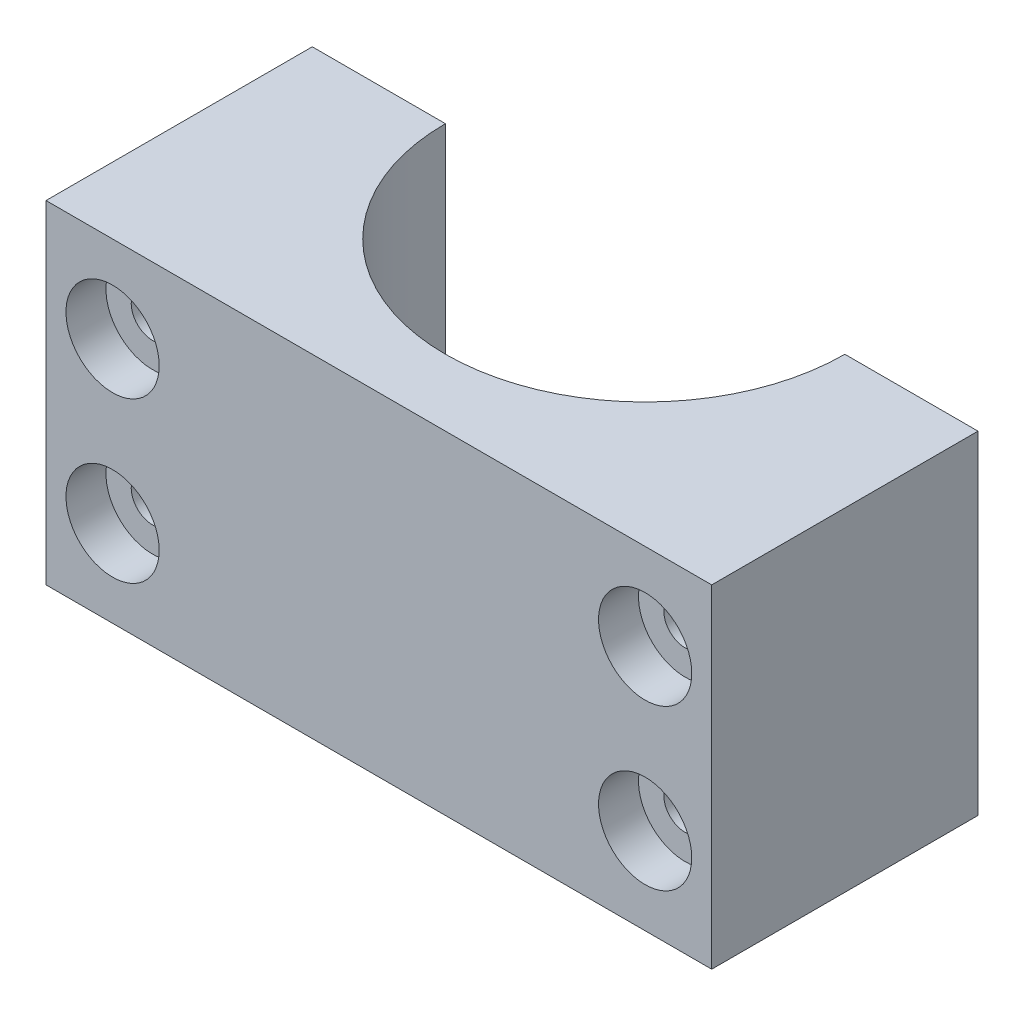
ISO-10303-21;
HEADER;
FILE_DESCRIPTION(('STEP AP214'),'2;1');
FILE_NAME('part.step','',(''),(''),'','','');
FILE_SCHEMA(('AUTOMOTIVE_DESIGN { 1 0 10303 214 1 1 1 1 }'));
ENDSEC;
DATA;
#1=APPLICATION_CONTEXT('core data for automotive mechanical design processes');
#2=APPLICATION_PROTOCOL_DEFINITION('international standard','automotive_design',2000,#1);
#3=PRODUCT_CONTEXT('',#1,'mechanical');
#4=PRODUCT('Part','Part','',(#3));
#5=PRODUCT_RELATED_PRODUCT_CATEGORY('part','',(#4));
#6=PRODUCT_DEFINITION_FORMATION('','',#4);
#7=PRODUCT_DEFINITION_CONTEXT('part definition',#1,'design');
#8=PRODUCT_DEFINITION('design','',#6,#7);
#9=PRODUCT_DEFINITION_SHAPE('','',#8);
#10=(LENGTH_UNIT() NAMED_UNIT(*) SI_UNIT(.MILLI.,.METRE.));
#11=(NAMED_UNIT(*) PLANE_ANGLE_UNIT() SI_UNIT($,.RADIAN.));
#12=(NAMED_UNIT(*) SI_UNIT($,.STERADIAN.) SOLID_ANGLE_UNIT());
#13=UNCERTAINTY_MEASURE_WITH_UNIT(LENGTH_MEASURE(1.E-05),#10,'distance_accuracy_value','');
#14=(GEOMETRIC_REPRESENTATION_CONTEXT(3) GLOBAL_UNCERTAINTY_ASSIGNED_CONTEXT((#13)) GLOBAL_UNIT_ASSIGNED_CONTEXT((#10,
#11,#12)) REPRESENTATION_CONTEXT('',''));
#15=CARTESIAN_POINT('',(0.,0.,0.));
#16=DIRECTION('',(0.,0.,1.));
#17=DIRECTION('',(1.,0.,0.));
#18=AXIS2_PLACEMENT_3D('',#15,#16,#17);
#19=CARTESIAN_POINT('',(20.0276243093923,6.5,45.));
#20=DIRECTION('',(0.,0.,-1.));
#21=DIRECTION('',(-1.,0.,0.));
#22=AXIS2_PLACEMENT_3D('',#19,#20,#21);
#23=CYLINDRICAL_SURFACE('',#22,1.6);
#24=CARTESIAN_POINT('',(20.0276243093923,6.5,0.));
#25=DIRECTION('',(0.,0.,-1.));
#26=DIRECTION('',(-1.,0.,0.));
#27=AXIS2_PLACEMENT_3D('',#24,#25,#26);
#28=CIRCLE('',#27,1.6);
#29=CARTESIAN_POINT('',(18.4276243093923,6.5,0.));
#30=VERTEX_POINT('',#29);
#31=EDGE_CURVE('E125',#30,#30,#28,.T.);
#32=ORIENTED_EDGE('',*,*,#31,.T.);
#33=EDGE_LOOP('',(#32));
#34=FACE_BOUND('',#33,.T.);
#35=CARTESIAN_POINT('',(20.0276243093923,6.5,17.));
#36=DIRECTION('',(0.,0.,1.));
#37=DIRECTION('',(1.,0.,0.));
#38=AXIS2_PLACEMENT_3D('',#35,#36,#37);
#39=CIRCLE('',#38,1.6);
#40=CARTESIAN_POINT('',(21.6276243093923,6.5,17.));
#41=VERTEX_POINT('',#40);
#42=EDGE_CURVE('E38',#41,#41,#39,.F.);
#43=ORIENTED_EDGE('',*,*,#42,.F.);
#44=EDGE_LOOP('',(#43));
#45=FACE_BOUND('',#44,.T.);
#46=ADVANCED_FACE('F34',(#34,#45),#23,.F.);
#47=CARTESIAN_POINT('',(-19.9723756906077,18.5,45.));
#48=DIRECTION('',(0.,0.,-1.));
#49=DIRECTION('',(-1.,0.,0.));
#50=AXIS2_PLACEMENT_3D('',#47,#48,#49);
#51=CYLINDRICAL_SURFACE('',#50,1.6);
#52=CARTESIAN_POINT('',(-19.9723756906077,18.5,0.));
#53=DIRECTION('',(0.,0.,-1.));
#54=DIRECTION('',(-1.,0.,0.));
#55=AXIS2_PLACEMENT_3D('',#52,#53,#54);
#56=CIRCLE('',#55,1.6);
#57=CARTESIAN_POINT('',(-21.5723756906077,18.5,0.));
#58=VERTEX_POINT('',#57);
#59=EDGE_CURVE('E141',#58,#58,#56,.T.);
#60=ORIENTED_EDGE('',*,*,#59,.T.);
#61=EDGE_LOOP('',(#60));
#62=FACE_BOUND('',#61,.T.);
#63=CARTESIAN_POINT('',(-19.9723756906077,18.5,17.));
#64=DIRECTION('',(0.,0.,1.));
#65=DIRECTION('',(1.,0.,0.));
#66=AXIS2_PLACEMENT_3D('',#63,#64,#65);
#67=CIRCLE('',#66,1.6);
#68=CARTESIAN_POINT('',(-18.3723756906077,18.5,17.));
#69=VERTEX_POINT('',#68);
#70=EDGE_CURVE('E145',#69,#69,#67,.F.);
#71=ORIENTED_EDGE('',*,*,#70,.F.);
#72=EDGE_LOOP('',(#71));
#73=FACE_BOUND('',#72,.T.);
#74=ADVANCED_FACE('F197',(#62,#73),#51,.F.);
#75=CARTESIAN_POINT('',(-19.9723756906077,6.5,45.));
#76=DIRECTION('',(0.,0.,-1.));
#77=DIRECTION('',(-1.,0.,0.));
#78=AXIS2_PLACEMENT_3D('',#75,#76,#77);
#79=CYLINDRICAL_SURFACE('',#78,1.6);
#80=CARTESIAN_POINT('',(-19.9723756906077,6.5,0.));
#81=DIRECTION('',(0.,0.,-1.));
#82=DIRECTION('',(-1.,0.,0.));
#83=AXIS2_PLACEMENT_3D('',#80,#81,#82);
#84=CIRCLE('',#83,1.6);
#85=CARTESIAN_POINT('',(-21.5723756906077,6.5,0.));
#86=VERTEX_POINT('',#85);
#87=EDGE_CURVE('E165',#86,#86,#84,.T.);
#88=ORIENTED_EDGE('',*,*,#87,.T.);
#89=EDGE_LOOP('',(#88));
#90=FACE_BOUND('',#89,.T.);
#91=CARTESIAN_POINT('',(-19.9723756906077,6.5,17.));
#92=DIRECTION('',(0.,0.,1.));
#93=DIRECTION('',(1.,0.,0.));
#94=AXIS2_PLACEMENT_3D('',#91,#92,#93);
#95=CIRCLE('',#94,1.6);
#96=CARTESIAN_POINT('',(-18.3723756906077,6.5,17.));
#97=VERTEX_POINT('',#96);
#98=EDGE_CURVE('E143',#97,#97,#95,.F.);
#99=ORIENTED_EDGE('',*,*,#98,.F.);
#100=EDGE_LOOP('',(#99));
#101=FACE_BOUND('',#100,.T.);
#102=ADVANCED_FACE('F203',(#90,#101),#79,.F.);
#103=CARTESIAN_POINT('',(20.0276243093923,18.5,45.));
#104=DIRECTION('',(0.,0.,-1.));
#105=DIRECTION('',(-1.,0.,0.));
#106=AXIS2_PLACEMENT_3D('',#103,#104,#105);
#107=CYLINDRICAL_SURFACE('',#106,1.6);
#108=CARTESIAN_POINT('',(20.0276243093923,18.5,0.));
#109=DIRECTION('',(0.,0.,-1.));
#110=DIRECTION('',(-1.,0.,0.));
#111=AXIS2_PLACEMENT_3D('',#108,#109,#110);
#112=CIRCLE('',#111,1.6);
#113=CARTESIAN_POINT('',(18.4276243093923,18.5,0.));
#114=VERTEX_POINT('',#113);
#115=EDGE_CURVE('E162',#114,#114,#112,.T.);
#116=ORIENTED_EDGE('',*,*,#115,.T.);
#117=EDGE_LOOP('',(#116));
#118=FACE_BOUND('',#117,.T.);
#119=CARTESIAN_POINT('',(20.0276243093923,18.5,17.));
#120=DIRECTION('',(0.,0.,1.));
#121=DIRECTION('',(1.,0.,0.));
#122=AXIS2_PLACEMENT_3D('',#119,#120,#121);
#123=CIRCLE('',#122,1.6);
#124=CARTESIAN_POINT('',(21.6276243093923,18.5,17.));
#125=VERTEX_POINT('',#124);
#126=EDGE_CURVE('E138',#125,#125,#123,.F.);
#127=ORIENTED_EDGE('',*,*,#126,.F.);
#128=EDGE_LOOP('',(#127));
#129=FACE_BOUND('',#128,.T.);
#130=ADVANCED_FACE('F227',(#118,#129),#107,.F.);
#131=CARTESIAN_POINT('',(-24.9723756906077,25.,0.));
#132=DIRECTION('',(1.,0.,0.));
#133=DIRECTION('',(0.,0.,-1.));
#134=AXIS2_PLACEMENT_3D('',#131,#132,#133);
#135=PLANE('',#134);
#136=DIRECTION('',(0.,0.,1.));
#137=VECTOR('',#136,1.);
#138=CARTESIAN_POINT('',(-24.9723756906077,0.,0.));
#139=LINE('',#138,#137);
#140=CARTESIAN_POINT('',(-24.9723756906077,0.,0.));
#141=VERTEX_POINT('',#140);
#142=CARTESIAN_POINT('',(-24.9723756906077,0.,20.));
#143=VERTEX_POINT('',#142);
#144=EDGE_CURVE('E121',#141,#143,#139,.T.);
#145=ORIENTED_EDGE('',*,*,#144,.T.);
#146=DIRECTION('',(0.,-1.,0.));
#147=VECTOR('',#146,1.);
#148=CARTESIAN_POINT('',(-24.9723756906077,25.,20.));
#149=LINE('',#148,#147);
#150=CARTESIAN_POINT('',(-24.9723756906077,25.,20.));
#151=VERTEX_POINT('',#150);
#152=EDGE_CURVE('E11',#151,#143,#149,.T.);
#153=ORIENTED_EDGE('',*,*,#152,.F.);
#154=DIRECTION('',(0.,0.,1.));
#155=VECTOR('',#154,1.);
#156=CARTESIAN_POINT('',(-24.9723756906077,25.,0.));
#157=LINE('',#156,#155);
#158=CARTESIAN_POINT('',(-24.9723756906077,25.,0.));
#159=VERTEX_POINT('',#158);
#160=EDGE_CURVE('E132',#159,#151,#157,.T.);
#161=ORIENTED_EDGE('',*,*,#160,.F.);
#162=DIRECTION('',(0.,-1.,0.));
#163=VECTOR('',#162,1.);
#164=CARTESIAN_POINT('',(-24.9723756906077,25.,0.));
#165=LINE('',#164,#163);
#166=EDGE_CURVE('E117',#159,#141,#165,.T.);
#167=ORIENTED_EDGE('',*,*,#166,.T.);
#168=EDGE_LOOP('',(#145,#153,#161,#167));
#169=FACE_BOUND('',#168,.T.);
#170=ADVANCED_FACE('F36',(#169),#135,.F.);
#171=CARTESIAN_POINT('',(5.02762430939227,25.,20.));
#172=DIRECTION('',(0.,0.,-1.));
#173=DIRECTION('',(-1.,0.,0.));
#174=AXIS2_PLACEMENT_3D('',#171,#172,#173);
#175=PLANE('',#174);
#176=CARTESIAN_POINT('',(20.0276243093923,6.5,20.));
#177=DIRECTION('',(0.,0.,1.));
#178=DIRECTION('',(1.,0.,0.));
#179=AXIS2_PLACEMENT_3D('',#176,#177,#178);
#180=CIRCLE('',#179,3.5);
#181=CARTESIAN_POINT('',(23.5276243093923,6.5,20.));
#182=VERTEX_POINT('',#181);
#183=EDGE_CURVE('E270',#182,#182,#180,.T.);
#184=ORIENTED_EDGE('',*,*,#183,.F.);
#185=EDGE_LOOP('',(#184));
#186=FACE_BOUND('',#185,.T.);
#187=CARTESIAN_POINT('',(-19.9723756906077,6.5,20.));
#188=DIRECTION('',(0.,0.,1.));
#189=DIRECTION('',(1.,0.,0.));
#190=AXIS2_PLACEMENT_3D('',#187,#188,#189);
#191=CIRCLE('',#190,3.5);
#192=CARTESIAN_POINT('',(-16.4723756906077,6.5,20.));
#193=VERTEX_POINT('',#192);
#194=EDGE_CURVE('E261',#193,#193,#191,.T.);
#195=ORIENTED_EDGE('',*,*,#194,.F.);
#196=EDGE_LOOP('',(#195));
#197=FACE_BOUND('',#196,.T.);
#198=CARTESIAN_POINT('',(-19.9723756906077,18.5,20.));
#199=DIRECTION('',(0.,0.,1.));
#200=DIRECTION('',(1.,0.,0.));
#201=AXIS2_PLACEMENT_3D('',#198,#199,#200);
#202=CIRCLE('',#201,3.5);
#203=CARTESIAN_POINT('',(-16.4723756906077,18.5,20.));
#204=VERTEX_POINT('',#203);
#205=EDGE_CURVE('E262',#204,#204,#202,.T.);
#206=ORIENTED_EDGE('',*,*,#205,.F.);
#207=EDGE_LOOP('',(#206));
#208=FACE_BOUND('',#207,.T.);
#209=CARTESIAN_POINT('',(20.0276243093923,18.5,20.));
#210=DIRECTION('',(0.,0.,1.));
#211=DIRECTION('',(1.,0.,0.));
#212=AXIS2_PLACEMENT_3D('',#209,#210,#211);
#213=CIRCLE('',#212,3.5);
#214=CARTESIAN_POINT('',(23.5276243093923,18.5,20.));
#215=VERTEX_POINT('',#214);
#216=EDGE_CURVE('E151',#215,#215,#213,.T.);
#217=ORIENTED_EDGE('',*,*,#216,.F.);
#218=EDGE_LOOP('',(#217));
#219=FACE_BOUND('',#218,.T.);
#220=DIRECTION('',(1.,0.,0.));
#221=VECTOR('',#220,1.);
#222=CARTESIAN_POINT('',(5.02762430939227,0.,20.));
#223=LINE('',#222,#221);
#224=CARTESIAN_POINT('',(25.0276243093923,0.,20.));
#225=VERTEX_POINT('',#224);
#226=EDGE_CURVE('E124',#143,#225,#223,.T.);
#227=ORIENTED_EDGE('',*,*,#226,.T.);
#228=DIRECTION('',(0.,-1.,0.));
#229=VECTOR('',#228,1.);
#230=CARTESIAN_POINT('',(25.0276243093923,25.,20.));
#231=LINE('',#230,#229);
#232=CARTESIAN_POINT('',(25.0276243093923,25.,20.));
#233=VERTEX_POINT('',#232);
#234=EDGE_CURVE('E44',#233,#225,#231,.T.);
#235=ORIENTED_EDGE('',*,*,#234,.F.);
#236=DIRECTION('',(1.,0.,0.));
#237=VECTOR('',#236,1.);
#238=CARTESIAN_POINT('',(-24.9723756906077,25.,20.));
#239=LINE('',#238,#237);
#240=EDGE_CURVE('E90',#151,#233,#239,.T.);
#241=ORIENTED_EDGE('',*,*,#240,.F.);
#242=ORIENTED_EDGE('',*,*,#152,.T.);
#243=EDGE_LOOP('',(#227,#235,#241,#242));
#244=FACE_BOUND('',#243,.T.);
#245=ADVANCED_FACE('F175',(#186,#197,#208,#219,#244),#175,.F.);
#246=CARTESIAN_POINT('',(25.0276243093923,25.,20.));
#247=DIRECTION('',(-1.,0.,0.));
#248=DIRECTION('',(0.,0.,1.));
#249=AXIS2_PLACEMENT_3D('',#246,#247,#248);
#250=PLANE('',#249);
#251=DIRECTION('',(0.,0.,-1.));
#252=VECTOR('',#251,1.);
#253=CARTESIAN_POINT('',(25.0276243093923,0.,20.));
#254=LINE('',#253,#252);
#255=CARTESIAN_POINT('',(25.0276243093923,0.,0.));
#256=VERTEX_POINT('',#255);
#257=EDGE_CURVE('E127',#225,#256,#254,.T.);
#258=ORIENTED_EDGE('',*,*,#257,.T.);
#259=DIRECTION('',(0.,-1.,0.));
#260=VECTOR('',#259,1.);
#261=CARTESIAN_POINT('',(25.0276243093923,25.,0.));
#262=LINE('',#261,#260);
#263=CARTESIAN_POINT('',(25.0276243093923,25.,0.));
#264=VERTEX_POINT('',#263);
#265=EDGE_CURVE('E112',#264,#256,#262,.T.);
#266=ORIENTED_EDGE('',*,*,#265,.F.);
#267=DIRECTION('',(0.,0.,-1.));
#268=VECTOR('',#267,1.);
#269=CARTESIAN_POINT('',(25.0276243093923,25.,20.));
#270=LINE('',#269,#268);
#271=EDGE_CURVE('E103',#233,#264,#270,.T.);
#272=ORIENTED_EDGE('',*,*,#271,.F.);
#273=ORIENTED_EDGE('',*,*,#234,.T.);
#274=EDGE_LOOP('',(#258,#266,#272,#273));
#275=FACE_BOUND('',#274,.T.);
#276=ADVANCED_FACE('F178',(#275),#250,.F.);
#277=CARTESIAN_POINT('',(15.0276243093923,25.,0.));
#278=DIRECTION('',(0.,0.,1.));
#279=DIRECTION('',(1.,0.,0.));
#280=AXIS2_PLACEMENT_3D('',#277,#278,#279);
#281=PLANE('',#280);
#282=ORIENTED_EDGE('',*,*,#115,.F.);
#283=EDGE_LOOP('',(#282));
#284=FACE_BOUND('',#283,.T.);
#285=ORIENTED_EDGE('',*,*,#31,.F.);
#286=EDGE_LOOP('',(#285));
#287=FACE_BOUND('',#286,.T.);
#288=DIRECTION('',(-1.,0.,0.));
#289=VECTOR('',#288,1.);
#290=CARTESIAN_POINT('',(15.0276243093923,0.,0.));
#291=LINE('',#290,#289);
#292=CARTESIAN_POINT('',(15.0276243093923,0.,0.));
#293=VERTEX_POINT('',#292);
#294=EDGE_CURVE('E111',#256,#293,#291,.T.);
#295=ORIENTED_EDGE('',*,*,#294,.T.);
#296=DIRECTION('',(0.,-1.,0.));
#297=VECTOR('',#296,1.);
#298=CARTESIAN_POINT('',(15.0276243093923,25.,0.));
#299=LINE('',#298,#297);
#300=CARTESIAN_POINT('',(15.0276243093923,25.,0.));
#301=VERTEX_POINT('',#300);
#302=EDGE_CURVE('E108',#301,#293,#299,.T.);
#303=ORIENTED_EDGE('',*,*,#302,.F.);
#304=DIRECTION('',(-1.,0.,0.));
#305=VECTOR('',#304,1.);
#306=CARTESIAN_POINT('',(15.0276243093923,25.,0.));
#307=LINE('',#306,#305);
#308=EDGE_CURVE('E97',#264,#301,#307,.T.);
#309=ORIENTED_EDGE('',*,*,#308,.F.);
#310=ORIENTED_EDGE('',*,*,#265,.T.);
#311=EDGE_LOOP('',(#295,#303,#309,#310));
#312=FACE_BOUND('',#311,.T.);
#313=ADVANCED_FACE('F109',(#284,#287,#312),#281,.F.);
#314=CARTESIAN_POINT('',(0.0276243093922613,25.,0.));
#315=DIRECTION('',(0.,-1.,0.));
#316=DIRECTION('',(0.,0.,-1.));
#317=AXIS2_PLACEMENT_3D('',#314,#315,#316);
#318=CYLINDRICAL_SURFACE('',#317,15.);
#319=CARTESIAN_POINT('',(0.0276243093922613,0.,0.));
#320=DIRECTION('',(0.,-1.,0.));
#321=DIRECTION('',(0.,0.,1.));
#322=AXIS2_PLACEMENT_3D('',#319,#320,#321);
#323=CIRCLE('',#322,15.);
#324=CARTESIAN_POINT('',(-14.9723756906077,0.,0.));
#325=VERTEX_POINT('',#324);
#326=EDGE_CURVE('E76',#293,#325,#323,.T.);
#327=ORIENTED_EDGE('',*,*,#326,.T.);
#328=DIRECTION('',(0.,-1.,0.));
#329=VECTOR('',#328,1.);
#330=CARTESIAN_POINT('',(-14.9723756906077,25.,0.));
#331=LINE('',#330,#329);
#332=CARTESIAN_POINT('',(-14.9723756906077,25.,0.));
#333=VERTEX_POINT('',#332);
#334=EDGE_CURVE('E113',#333,#325,#331,.T.);
#335=ORIENTED_EDGE('',*,*,#334,.F.);
#336=CARTESIAN_POINT('',(0.0276243093922613,25.,0.));
#337=DIRECTION('',(0.,-1.,0.));
#338=DIRECTION('',(0.,0.,1.));
#339=AXIS2_PLACEMENT_3D('',#336,#337,#338);
#340=CIRCLE('',#339,15.);
#341=EDGE_CURVE('E101',#301,#333,#340,.T.);
#342=ORIENTED_EDGE('',*,*,#341,.F.);
#343=ORIENTED_EDGE('',*,*,#302,.T.);
#344=EDGE_LOOP('',(#327,#335,#342,#343));
#345=FACE_BOUND('',#344,.T.);
#346=ADVANCED_FACE('F115',(#345),#318,.F.);
#347=CARTESIAN_POINT('',(-14.9723756906077,25.,0.));
#348=DIRECTION('',(0.,0.,1.));
#349=DIRECTION('',(1.,0.,0.));
#350=AXIS2_PLACEMENT_3D('',#347,#348,#349);
#351=PLANE('',#350);
#352=ORIENTED_EDGE('',*,*,#87,.F.);
#353=EDGE_LOOP('',(#352));
#354=FACE_BOUND('',#353,.T.);
#355=ORIENTED_EDGE('',*,*,#59,.F.);
#356=EDGE_LOOP('',(#355));
#357=FACE_BOUND('',#356,.T.);
#358=DIRECTION('',(-1.,0.,0.));
#359=VECTOR('',#358,1.);
#360=CARTESIAN_POINT('',(-14.9723756906077,0.,0.));
#361=LINE('',#360,#359);
#362=EDGE_CURVE('E82',#325,#141,#361,.T.);
#363=ORIENTED_EDGE('',*,*,#362,.T.);
#364=ORIENTED_EDGE('',*,*,#166,.F.);
#365=DIRECTION('',(-1.,0.,0.));
#366=VECTOR('',#365,1.);
#367=CARTESIAN_POINT('',(-14.9723756906077,25.,0.));
#368=LINE('',#367,#366);
#369=EDGE_CURVE('E53',#333,#159,#368,.T.);
#370=ORIENTED_EDGE('',*,*,#369,.F.);
#371=ORIENTED_EDGE('',*,*,#334,.T.);
#372=EDGE_LOOP('',(#363,#364,#370,#371));
#373=FACE_BOUND('',#372,.T.);
#374=ADVANCED_FACE('F183',(#354,#357,#373),#351,.F.);
#375=CARTESIAN_POINT('',(0.0276243093922613,25.,0.));
#376=DIRECTION('',(0.,1.,0.));
#377=DIRECTION('',(0.,0.,1.));
#378=AXIS2_PLACEMENT_3D('',#375,#376,#377);
#379=PLANE('',#378);
#380=ORIENTED_EDGE('',*,*,#240,.T.);
#381=ORIENTED_EDGE('',*,*,#271,.T.);
#382=ORIENTED_EDGE('',*,*,#308,.T.);
#383=ORIENTED_EDGE('',*,*,#341,.T.);
#384=ORIENTED_EDGE('',*,*,#369,.T.);
#385=ORIENTED_EDGE('',*,*,#160,.T.);
#386=EDGE_LOOP('',(#380,#381,#382,#383,#384,#385));
#387=FACE_BOUND('',#386,.T.);
#388=ADVANCED_FACE('F99',(#387),#379,.T.);
#389=CARTESIAN_POINT('',(0.0276243093922613,0.,0.));
#390=DIRECTION('',(0.,1.,0.));
#391=DIRECTION('',(0.,0.,1.));
#392=AXIS2_PLACEMENT_3D('',#389,#390,#391);
#393=PLANE('',#392);
#394=ORIENTED_EDGE('',*,*,#226,.F.);
#395=ORIENTED_EDGE('',*,*,#144,.F.);
#396=ORIENTED_EDGE('',*,*,#362,.F.);
#397=ORIENTED_EDGE('',*,*,#326,.F.);
#398=ORIENTED_EDGE('',*,*,#294,.F.);
#399=ORIENTED_EDGE('',*,*,#257,.F.);
#400=EDGE_LOOP('',(#394,#395,#396,#397,#398,#399));
#401=FACE_BOUND('',#400,.T.);
#402=ADVANCED_FACE('F180',(#401),#393,.F.);
#403=CARTESIAN_POINT('',(20.0276243093923,18.5,17.));
#404=DIRECTION('',(0.,0.,1.));
#405=DIRECTION('',(1.,0.,0.));
#406=AXIS2_PLACEMENT_3D('',#403,#404,#405);
#407=PLANE('',#406);
#408=CARTESIAN_POINT('',(20.0276243093923,18.5,17.));
#409=DIRECTION('',(0.,0.,1.));
#410=DIRECTION('',(1.,0.,0.));
#411=AXIS2_PLACEMENT_3D('',#408,#409,#410);
#412=CIRCLE('',#411,3.5);
#413=CARTESIAN_POINT('',(23.5276243093923,18.5,17.));
#414=VERTEX_POINT('',#413);
#415=EDGE_CURVE('E142',#414,#414,#412,.T.);
#416=ORIENTED_EDGE('',*,*,#415,.T.);
#417=EDGE_LOOP('',(#416));
#418=FACE_BOUND('',#417,.T.);
#419=ORIENTED_EDGE('',*,*,#126,.T.);
#420=EDGE_LOOP('',(#419));
#421=FACE_BOUND('',#420,.T.);
#422=ADVANCED_FACE('F209',(#418,#421),#407,.T.);
#423=CARTESIAN_POINT('',(20.0276243093923,18.5,17.));
#424=DIRECTION('',(0.,0.,1.));
#425=DIRECTION('',(1.,0.,0.));
#426=AXIS2_PLACEMENT_3D('',#423,#424,#425);
#427=CYLINDRICAL_SURFACE('',#426,3.5);
#428=ORIENTED_EDGE('',*,*,#415,.F.);
#429=EDGE_LOOP('',(#428));
#430=FACE_BOUND('',#429,.T.);
#431=ORIENTED_EDGE('',*,*,#216,.T.);
#432=EDGE_LOOP('',(#431));
#433=FACE_BOUND('',#432,.T.);
#434=ADVANCED_FACE('F213',(#430,#433),#427,.F.);
#435=CARTESIAN_POINT('',(-19.9723756906077,6.5,17.));
#436=DIRECTION('',(0.,0.,1.));
#437=DIRECTION('',(1.,0.,0.));
#438=AXIS2_PLACEMENT_3D('',#435,#436,#437);
#439=PLANE('',#438);
#440=CARTESIAN_POINT('',(-19.9723756906077,6.5,17.));
#441=DIRECTION('',(0.,0.,1.));
#442=DIRECTION('',(1.,0.,0.));
#443=AXIS2_PLACEMENT_3D('',#440,#441,#442);
#444=CIRCLE('',#443,3.5);
#445=CARTESIAN_POINT('',(-16.4723756906077,6.5,17.));
#446=VERTEX_POINT('',#445);
#447=EDGE_CURVE('E265',#446,#446,#444,.T.);
#448=ORIENTED_EDGE('',*,*,#447,.T.);
#449=EDGE_LOOP('',(#448));
#450=FACE_BOUND('',#449,.T.);
#451=ORIENTED_EDGE('',*,*,#98,.T.);
#452=EDGE_LOOP('',(#451));
#453=FACE_BOUND('',#452,.T.);
#454=ADVANCED_FACE('F219',(#450,#453),#439,.T.);
#455=CARTESIAN_POINT('',(-19.9723756906077,6.5,17.));
#456=DIRECTION('',(0.,0.,1.));
#457=DIRECTION('',(1.,0.,0.));
#458=AXIS2_PLACEMENT_3D('',#455,#456,#457);
#459=CYLINDRICAL_SURFACE('',#458,3.5);
#460=ORIENTED_EDGE('',*,*,#447,.F.);
#461=EDGE_LOOP('',(#460));
#462=FACE_BOUND('',#461,.T.);
#463=ORIENTED_EDGE('',*,*,#194,.T.);
#464=EDGE_LOOP('',(#463));
#465=FACE_BOUND('',#464,.T.);
#466=ADVANCED_FACE('F238',(#462,#465),#459,.F.);
#467=CARTESIAN_POINT('',(-19.9723756906077,18.5,17.));
#468=DIRECTION('',(0.,0.,1.));
#469=DIRECTION('',(1.,0.,0.));
#470=AXIS2_PLACEMENT_3D('',#467,#468,#469);
#471=PLANE('',#470);
#472=CARTESIAN_POINT('',(-19.9723756906077,18.5,17.));
#473=DIRECTION('',(0.,0.,1.));
#474=DIRECTION('',(1.,0.,0.));
#475=AXIS2_PLACEMENT_3D('',#472,#473,#474);
#476=CIRCLE('',#475,3.5);
#477=CARTESIAN_POINT('',(-16.4723756906077,18.5,17.));
#478=VERTEX_POINT('',#477);
#479=EDGE_CURVE('E260',#478,#478,#476,.T.);
#480=ORIENTED_EDGE('',*,*,#479,.T.);
#481=EDGE_LOOP('',(#480));
#482=FACE_BOUND('',#481,.T.);
#483=ORIENTED_EDGE('',*,*,#70,.T.);
#484=EDGE_LOOP('',(#483));
#485=FACE_BOUND('',#484,.T.);
#486=ADVANCED_FACE('F244',(#482,#485),#471,.T.);
#487=CARTESIAN_POINT('',(-19.9723756906077,18.5,17.));
#488=DIRECTION('',(0.,0.,1.));
#489=DIRECTION('',(1.,0.,0.));
#490=AXIS2_PLACEMENT_3D('',#487,#488,#489);
#491=CYLINDRICAL_SURFACE('',#490,3.5);
#492=ORIENTED_EDGE('',*,*,#479,.F.);
#493=EDGE_LOOP('',(#492));
#494=FACE_BOUND('',#493,.T.);
#495=ORIENTED_EDGE('',*,*,#205,.T.);
#496=EDGE_LOOP('',(#495));
#497=FACE_BOUND('',#496,.T.);
#498=ADVANCED_FACE('F224',(#494,#497),#491,.F.);
#499=CARTESIAN_POINT('',(20.0276243093923,6.5,17.));
#500=DIRECTION('',(0.,0.,1.));
#501=DIRECTION('',(1.,0.,0.));
#502=AXIS2_PLACEMENT_3D('',#499,#500,#501);
#503=PLANE('',#502);
#504=CARTESIAN_POINT('',(20.0276243093923,6.5,17.));
#505=DIRECTION('',(0.,0.,1.));
#506=DIRECTION('',(1.,0.,0.));
#507=AXIS2_PLACEMENT_3D('',#504,#505,#506);
#508=CIRCLE('',#507,3.5);
#509=CARTESIAN_POINT('',(23.5276243093923,6.5,17.));
#510=VERTEX_POINT('',#509);
#511=EDGE_CURVE('E146',#510,#510,#508,.T.);
#512=ORIENTED_EDGE('',*,*,#511,.T.);
#513=EDGE_LOOP('',(#512));
#514=FACE_BOUND('',#513,.T.);
#515=ORIENTED_EDGE('',*,*,#42,.T.);
#516=EDGE_LOOP('',(#515));
#517=FACE_BOUND('',#516,.T.);
#518=ADVANCED_FACE('F256',(#514,#517),#503,.T.);
#519=CARTESIAN_POINT('',(20.0276243093923,6.5,17.));
#520=DIRECTION('',(0.,0.,1.));
#521=DIRECTION('',(1.,0.,0.));
#522=AXIS2_PLACEMENT_3D('',#519,#520,#521);
#523=CYLINDRICAL_SURFACE('',#522,3.5);
#524=ORIENTED_EDGE('',*,*,#511,.F.);
#525=EDGE_LOOP('',(#524));
#526=FACE_BOUND('',#525,.T.);
#527=ORIENTED_EDGE('',*,*,#183,.T.);
#528=EDGE_LOOP('',(#527));
#529=FACE_BOUND('',#528,.T.);
#530=ADVANCED_FACE('F249',(#526,#529),#523,.F.);
#531=CLOSED_SHELL('',(#46,#74,#102,#130,#170,#245,#276,#313,#346,#374,#388,#402,#422,#434,#454,
#466,#486,#498,#518,#530));
#532=MANIFOLD_SOLID_BREP('B2',#531);
#533=ADVANCED_BREP_SHAPE_REPRESENTATION('',(#18,#532),#14);
#534=SHAPE_DEFINITION_REPRESENTATION(#9,#533);
ENDSEC;
END-ISO-10303-21;
